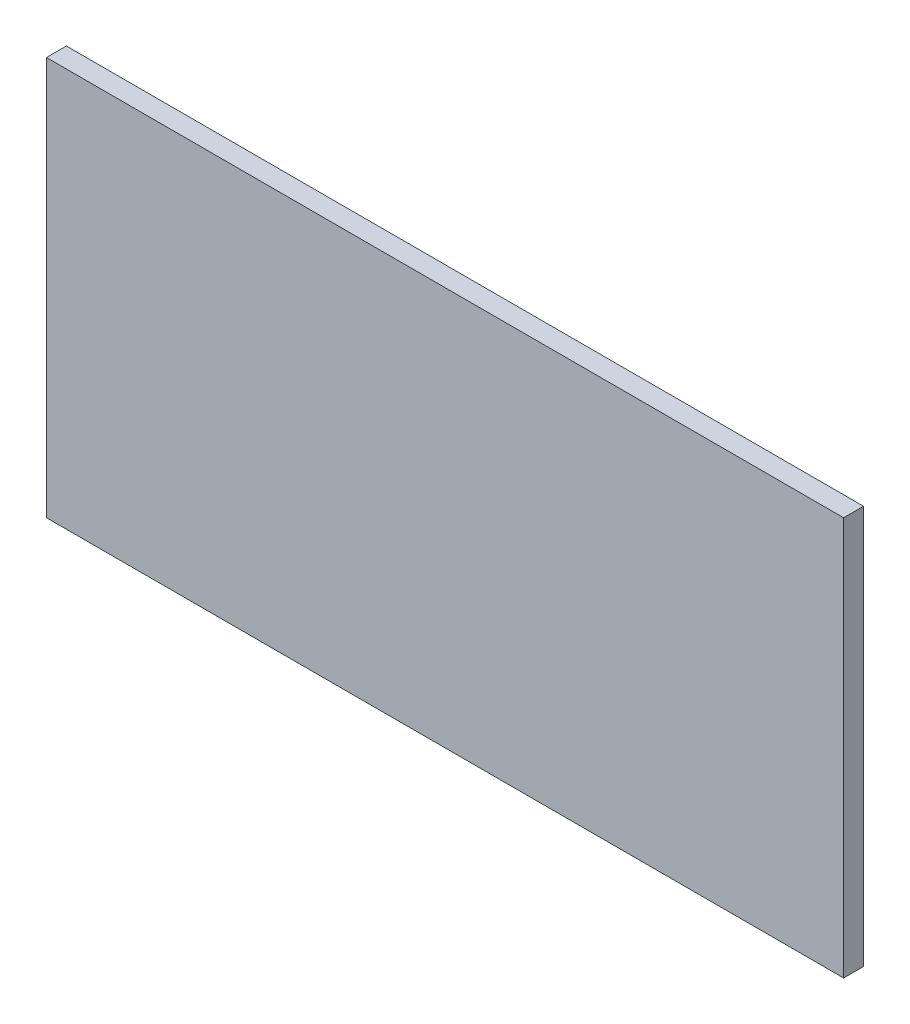
ISO-10303-21;
HEADER;
FILE_DESCRIPTION(('STEP AP214'),'2;1');
FILE_NAME('part.step','',(''),(''),'','','');
FILE_SCHEMA(('AUTOMOTIVE_DESIGN { 1 0 10303 214 1 1 1 1 }'));
ENDSEC;
DATA;
#1=APPLICATION_CONTEXT('core data for automotive mechanical design processes');
#2=APPLICATION_PROTOCOL_DEFINITION('international standard','automotive_design',2000,#1);
#3=PRODUCT_CONTEXT('',#1,'mechanical');
#4=PRODUCT('Part','Part','',(#3));
#5=PRODUCT_RELATED_PRODUCT_CATEGORY('part','',(#4));
#6=PRODUCT_DEFINITION_FORMATION('','',#4);
#7=PRODUCT_DEFINITION_CONTEXT('part definition',#1,'design');
#8=PRODUCT_DEFINITION('design','',#6,#7);
#9=PRODUCT_DEFINITION_SHAPE('','',#8);
#10=(LENGTH_UNIT() NAMED_UNIT(*) SI_UNIT(.MILLI.,.METRE.));
#11=(NAMED_UNIT(*) PLANE_ANGLE_UNIT() SI_UNIT($,.RADIAN.));
#12=(NAMED_UNIT(*) SI_UNIT($,.STERADIAN.) SOLID_ANGLE_UNIT());
#13=UNCERTAINTY_MEASURE_WITH_UNIT(LENGTH_MEASURE(1.E-05),#10,'distance_accuracy_value','');
#14=(GEOMETRIC_REPRESENTATION_CONTEXT(3) GLOBAL_UNCERTAINTY_ASSIGNED_CONTEXT((#13)) GLOBAL_UNIT_ASSIGNED_CONTEXT((#10,
#11,#12)) REPRESENTATION_CONTEXT('',''));
#15=CARTESIAN_POINT('',(0.,0.,0.));
#16=DIRECTION('',(0.,0.,1.));
#17=DIRECTION('',(1.,0.,0.));
#18=AXIS2_PLACEMENT_3D('',#15,#16,#17);
#19=CARTESIAN_POINT('',(60.,30.,3.));
#20=DIRECTION('',(-1.,0.,0.));
#21=DIRECTION('',(0.,0.,1.));
#22=AXIS2_PLACEMENT_3D('',#19,#20,#21);
#23=PLANE('',#22);
#24=DIRECTION('',(0.,1.,0.));
#25=VECTOR('',#24,1.);
#26=CARTESIAN_POINT('',(60.,30.,0.));
#27=LINE('',#26,#25);
#28=CARTESIAN_POINT('',(60.,-30.,0.));
#29=VERTEX_POINT('',#28);
#30=CARTESIAN_POINT('',(60.,30.,0.));
#31=VERTEX_POINT('',#30);
#32=EDGE_CURVE('E96',#29,#31,#27,.T.);
#33=ORIENTED_EDGE('',*,*,#32,.T.);
#34=DIRECTION('',(0.,0.,-1.));
#35=VECTOR('',#34,1.);
#36=CARTESIAN_POINT('',(60.,30.,3.));
#37=LINE('',#36,#35);
#38=CARTESIAN_POINT('',(60.,30.,3.));
#39=VERTEX_POINT('',#38);
#40=EDGE_CURVE('E11',#39,#31,#37,.T.);
#41=ORIENTED_EDGE('',*,*,#40,.F.);
#42=DIRECTION('',(0.,1.,0.));
#43=VECTOR('',#42,1.);
#44=CARTESIAN_POINT('',(60.,30.,3.));
#45=LINE('',#44,#43);
#46=CARTESIAN_POINT('',(60.,-30.,3.));
#47=VERTEX_POINT('',#46);
#48=EDGE_CURVE('E84',#47,#39,#45,.T.);
#49=ORIENTED_EDGE('',*,*,#48,.F.);
#50=DIRECTION('',(0.,0.,-1.));
#51=VECTOR('',#50,1.);
#52=CARTESIAN_POINT('',(60.,-30.,3.));
#53=LINE('',#52,#51);
#54=EDGE_CURVE('E92',#47,#29,#53,.T.);
#55=ORIENTED_EDGE('',*,*,#54,.T.);
#56=EDGE_LOOP('',(#33,#41,#49,#55));
#57=FACE_BOUND('',#56,.T.);
#58=ADVANCED_FACE('F33',(#57),#23,.F.);
#59=CARTESIAN_POINT('',(-60.,30.,3.));
#60=DIRECTION('',(0.,-1.,0.));
#61=DIRECTION('',(0.,0.,-1.));
#62=AXIS2_PLACEMENT_3D('',#59,#60,#61);
#63=PLANE('',#62);
#64=DIRECTION('',(-1.,0.,0.));
#65=VECTOR('',#64,1.);
#66=CARTESIAN_POINT('',(-60.,30.,0.));
#67=LINE('',#66,#65);
#68=CARTESIAN_POINT('',(-60.,30.,0.));
#69=VERTEX_POINT('',#68);
#70=EDGE_CURVE('E88',#31,#69,#67,.T.);
#71=ORIENTED_EDGE('',*,*,#70,.T.);
#72=DIRECTION('',(0.,0.,-1.));
#73=VECTOR('',#72,1.);
#74=CARTESIAN_POINT('',(-60.,30.,3.));
#75=LINE('',#74,#73);
#76=CARTESIAN_POINT('',(-60.,30.,3.));
#77=VERTEX_POINT('',#76);
#78=EDGE_CURVE('E41',#77,#69,#75,.T.);
#79=ORIENTED_EDGE('',*,*,#78,.F.);
#80=DIRECTION('',(-1.,0.,0.));
#81=VECTOR('',#80,1.);
#82=CARTESIAN_POINT('',(-60.,30.,3.));
#83=LINE('',#82,#81);
#84=EDGE_CURVE('E79',#39,#77,#83,.T.);
#85=ORIENTED_EDGE('',*,*,#84,.F.);
#86=ORIENTED_EDGE('',*,*,#40,.T.);
#87=EDGE_LOOP('',(#71,#79,#85,#86));
#88=FACE_BOUND('',#87,.T.);
#89=ADVANCED_FACE('F87',(#88),#63,.F.);
#90=CARTESIAN_POINT('',(-60.,30.,3.));
#91=DIRECTION('',(1.,0.,0.));
#92=DIRECTION('',(0.,1.,0.));
#93=AXIS2_PLACEMENT_3D('',#90,#91,#92);
#94=PLANE('',#93);
#95=DIRECTION('',(0.,-1.,0.));
#96=VECTOR('',#95,1.);
#97=CARTESIAN_POINT('',(-60.,30.,0.));
#98=LINE('',#97,#96);
#99=CARTESIAN_POINT('',(-60.,-30.,0.));
#100=VERTEX_POINT('',#99);
#101=EDGE_CURVE('E66',#69,#100,#98,.T.);
#102=ORIENTED_EDGE('',*,*,#101,.T.);
#103=DIRECTION('',(0.,0.,-1.));
#104=VECTOR('',#103,1.);
#105=CARTESIAN_POINT('',(-60.,-30.,3.));
#106=LINE('',#105,#104);
#107=CARTESIAN_POINT('',(-60.,-30.,3.));
#108=VERTEX_POINT('',#107);
#109=EDGE_CURVE('E89',#108,#100,#106,.T.);
#110=ORIENTED_EDGE('',*,*,#109,.F.);
#111=DIRECTION('',(0.,-1.,0.));
#112=VECTOR('',#111,1.);
#113=CARTESIAN_POINT('',(-60.,30.,3.));
#114=LINE('',#113,#112);
#115=EDGE_CURVE('E82',#77,#108,#114,.T.);
#116=ORIENTED_EDGE('',*,*,#115,.F.);
#117=ORIENTED_EDGE('',*,*,#78,.T.);
#118=EDGE_LOOP('',(#102,#110,#116,#117));
#119=FACE_BOUND('',#118,.T.);
#120=ADVANCED_FACE('F90',(#119),#94,.F.);
#121=CARTESIAN_POINT('',(-60.,-30.,3.));
#122=DIRECTION('',(0.,1.,0.));
#123=DIRECTION('',(0.,0.,1.));
#124=AXIS2_PLACEMENT_3D('',#121,#122,#123);
#125=PLANE('',#124);
#126=DIRECTION('',(1.,0.,0.));
#127=VECTOR('',#126,1.);
#128=CARTESIAN_POINT('',(-60.,-30.,0.));
#129=LINE('',#128,#127);
#130=EDGE_CURVE('E72',#100,#29,#129,.T.);
#131=ORIENTED_EDGE('',*,*,#130,.T.);
#132=ORIENTED_EDGE('',*,*,#54,.F.);
#133=DIRECTION('',(1.,0.,0.));
#134=VECTOR('',#133,1.);
#135=CARTESIAN_POINT('',(-60.,-30.,3.));
#136=LINE('',#135,#134);
#137=EDGE_CURVE('E49',#108,#47,#136,.T.);
#138=ORIENTED_EDGE('',*,*,#137,.F.);
#139=ORIENTED_EDGE('',*,*,#109,.T.);
#140=EDGE_LOOP('',(#131,#132,#138,#139));
#141=FACE_BOUND('',#140,.T.);
#142=ADVANCED_FACE('F103',(#141),#125,.F.);
#143=CARTESIAN_POINT('',(0.,0.,3.));
#144=DIRECTION('',(0.,0.,1.));
#145=DIRECTION('',(1.,0.,0.));
#146=AXIS2_PLACEMENT_3D('',#143,#144,#145);
#147=PLANE('',#146);
#148=ORIENTED_EDGE('',*,*,#48,.T.);
#149=ORIENTED_EDGE('',*,*,#84,.T.);
#150=ORIENTED_EDGE('',*,*,#115,.T.);
#151=ORIENTED_EDGE('',*,*,#137,.T.);
#152=EDGE_LOOP('',(#148,#149,#150,#151));
#153=FACE_BOUND('',#152,.T.);
#154=ADVANCED_FACE('F80',(#153),#147,.T.);
#155=CARTESIAN_POINT('',(0.,0.,0.));
#156=DIRECTION('',(0.,0.,1.));
#157=DIRECTION('',(1.,0.,0.));
#158=AXIS2_PLACEMENT_3D('',#155,#156,#157);
#159=PLANE('',#158);
#160=ORIENTED_EDGE('',*,*,#32,.F.);
#161=ORIENTED_EDGE('',*,*,#130,.F.);
#162=ORIENTED_EDGE('',*,*,#101,.F.);
#163=ORIENTED_EDGE('',*,*,#70,.F.);
#164=EDGE_LOOP('',(#160,#161,#162,#163));
#165=FACE_BOUND('',#164,.T.);
#166=ADVANCED_FACE('F106',(#165),#159,.F.);
#167=CLOSED_SHELL('',(#58,#89,#120,#142,#154,#166));
#168=MANIFOLD_SOLID_BREP('B2',#167);
#169=ADVANCED_BREP_SHAPE_REPRESENTATION('',(#18,#168),#14);
#170=SHAPE_DEFINITION_REPRESENTATION(#9,#169);
ENDSEC;
END-ISO-10303-21;
